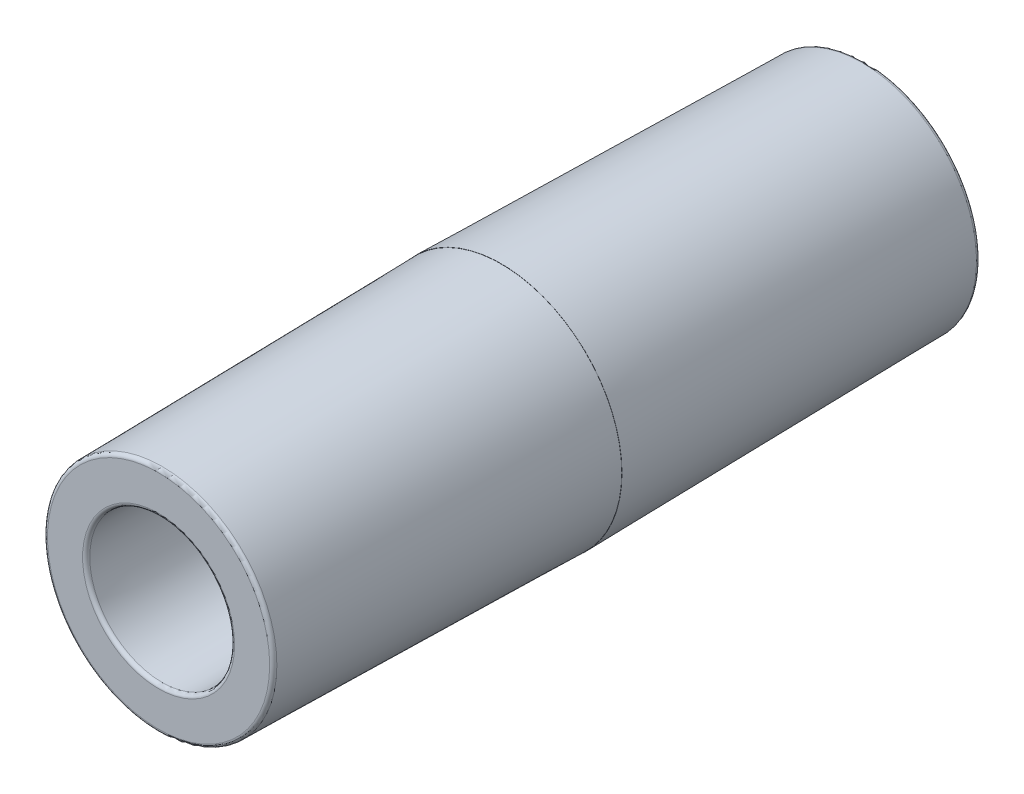
ISO-10303-21;
HEADER;
FILE_DESCRIPTION(('STEP AP214'),'2;1');
FILE_NAME('part.step','',(''),(''),'','','');
FILE_SCHEMA(('AUTOMOTIVE_DESIGN { 1 0 10303 214 1 1 1 1 }'));
ENDSEC;
DATA;
#1=APPLICATION_CONTEXT('core data for automotive mechanical design processes');
#2=APPLICATION_PROTOCOL_DEFINITION('international standard','automotive_design',2000,#1);
#3=PRODUCT_CONTEXT('',#1,'mechanical');
#4=PRODUCT('Part','Part','',(#3));
#5=PRODUCT_RELATED_PRODUCT_CATEGORY('part','',(#4));
#6=PRODUCT_DEFINITION_FORMATION('','',#4);
#7=PRODUCT_DEFINITION_CONTEXT('part definition',#1,'design');
#8=PRODUCT_DEFINITION('design','',#6,#7);
#9=PRODUCT_DEFINITION_SHAPE('','',#8);
#10=(LENGTH_UNIT() NAMED_UNIT(*) SI_UNIT(.MILLI.,.METRE.));
#11=(NAMED_UNIT(*) PLANE_ANGLE_UNIT() SI_UNIT($,.RADIAN.));
#12=(NAMED_UNIT(*) SI_UNIT($,.STERADIAN.) SOLID_ANGLE_UNIT());
#13=UNCERTAINTY_MEASURE_WITH_UNIT(LENGTH_MEASURE(1.E-05),#10,'distance_accuracy_value','');
#14=(GEOMETRIC_REPRESENTATION_CONTEXT(3) GLOBAL_UNCERTAINTY_ASSIGNED_CONTEXT((#13)) GLOBAL_UNIT_ASSIGNED_CONTEXT((#10,
#11,#12)) REPRESENTATION_CONTEXT('',''));
#15=CARTESIAN_POINT('',(0.,0.,0.));
#16=DIRECTION('',(0.,0.,1.));
#17=DIRECTION('',(1.,0.,0.));
#18=AXIS2_PLACEMENT_3D('',#15,#16,#17);
#19=CARTESIAN_POINT('',(7.99064286977399,0.,23.876));
#20=DIRECTION('',(0.,0.,1.));
#21=DIRECTION('',(1.,0.,0.));
#22=AXIS2_PLACEMENT_3D('',#19,#20,#21);
#23=PLANE('',#22);
#24=CARTESIAN_POINT('',(0.,0.,23.876));
#25=DIRECTION('',(0.,0.,1.));
#26=DIRECTION('',(1.,0.,0.));
#27=AXIS2_PLACEMENT_3D('',#24,#25,#26);
#28=CIRCLE('',#27,7.74103776494259);
#29=CARTESIAN_POINT('',(7.7410377649426,0.,23.876));
#30=VERTEX_POINT('',#29);
#31=EDGE_CURVE('E53',#30,#30,#28,.T.);
#32=ORIENTED_EDGE('',*,*,#31,.T.);
#33=EDGE_LOOP('',(#32));
#34=FACE_BOUND('',#33,.T.);
#35=CARTESIAN_POINT('',(0.,0.,23.876));
#36=DIRECTION('',(0.,0.,1.));
#37=DIRECTION('',(1.,0.,0.));
#38=AXIS2_PLACEMENT_3D('',#35,#36,#37);
#39=CIRCLE('',#38,5.29885574286328);
#40=CARTESIAN_POINT('',(5.29885574286328,0.,23.876));
#41=VERTEX_POINT('',#40);
#42=EDGE_CURVE('E56',#41,#41,#39,.F.);
#43=ORIENTED_EDGE('',*,*,#42,.T.);
#44=EDGE_LOOP('',(#43));
#45=FACE_BOUND('',#44,.T.);
#46=ADVANCED_FACE('F30',(#34,#45),#23,.T.);
#47=CARTESIAN_POINT('',(0.,0.,23.876));
#48=DIRECTION('',(0.,0.,1.));
#49=DIRECTION('',(1.,0.,0.));
#50=AXIS2_PLACEMENT_3D('',#47,#48,#49);
#51=CONICAL_SURFACE('',#50,5.04706269537215,0.00872664625996588);
#52=CARTESIAN_POINT('',(0.,0.,23.6242165400165));
#53=DIRECTION('',(0.,0.,-1.));
#54=DIRECTION('',(-1.,0.,0.));
#55=AXIS2_PLACEMENT_3D('',#52,#53,#54);
#56=CIRCLE('',#55,5.04486541440497);
#57=CARTESIAN_POINT('',(-5.04486541440497,0.,23.6242165400165));
#58=VERTEX_POINT('',#57);
#59=EDGE_CURVE('E50',#58,#58,#56,.F.);
#60=ORIENTED_EDGE('',*,*,#59,.T.);
#61=EDGE_LOOP('',(#60));
#62=FACE_BOUND('',#61,.T.);
#63=CARTESIAN_POINT('',(0.,0.,0.));
#64=DIRECTION('',(0.,0.,-1.));
#65=DIRECTION('',(-1.,0.,0.));
#66=AXIS2_PLACEMENT_3D('',#63,#64,#65);
#67=CIRCLE('',#66,4.83870000000013);
#68=CARTESIAN_POINT('',(-4.83870000000012,0.,0.));
#69=VERTEX_POINT('',#68);
#70=EDGE_CURVE('E62',#69,#69,#67,.T.);
#71=ORIENTED_EDGE('',*,*,#70,.T.);
#72=EDGE_LOOP('',(#71));
#73=FACE_BOUND('',#72,.T.);
#74=ADVANCED_FACE('F93',(#62,#73),#51,.F.);
#75=CARTESIAN_POINT('',(4.83870000000014,0.,0.));
#76=DIRECTION('',(0.,0.,-1.));
#77=DIRECTION('',(-1.,0.,0.));
#78=AXIS2_PLACEMENT_3D('',#75,#76,#77);
#79=PLANE('',#78);
#80=CARTESIAN_POINT('',(0.,0.,0.));
#81=DIRECTION('',(0.,0.,-1.));
#82=DIRECTION('',(-1.,0.,0.));
#83=AXIS2_PLACEMENT_3D('',#80,#81,#82);
#84=CIRCLE('',#83,4.85140000000023);
#85=CARTESIAN_POINT('',(-4.85140000000023,0.,0.));
#86=VERTEX_POINT('',#85);
#87=EDGE_CURVE('E65',#86,#86,#84,.T.);
#88=ORIENTED_EDGE('',*,*,#87,.T.);
#89=EDGE_LOOP('',(#88));
#90=FACE_BOUND('',#89,.T.);
#91=ORIENTED_EDGE('',*,*,#70,.F.);
#92=EDGE_LOOP('',(#91));
#93=FACE_BOUND('',#92,.T.);
#94=ADVANCED_FACE('F99',(#90,#93),#79,.T.);
#95=CARTESIAN_POINT('',(0.,0.,0.));
#96=DIRECTION('',(0.,0.,-1.));
#97=DIRECTION('',(-1.,0.,0.));
#98=AXIS2_PLACEMENT_3D('',#95,#96,#97);
#99=CONICAL_SURFACE('',#98,4.85140000000023,0.00872664625996334);
#100=CARTESIAN_POINT('',(0.,0.,-25.1482165400165));
#101=DIRECTION('',(0.,0.,1.));
#102=DIRECTION('',(1.,0.,0.));
#103=AXIS2_PLACEMENT_3D('',#100,#101,#102);
#104=CIRCLE('',#103,5.07086516091812);
#105=CARTESIAN_POINT('',(5.07086516091813,0.,-25.1482165400165));
#106=VERTEX_POINT('',#105);
#107=EDGE_CURVE('E45',#106,#106,#104,.F.);
#108=ORIENTED_EDGE('',*,*,#107,.T.);
#109=EDGE_LOOP('',(#108));
#110=FACE_BOUND('',#109,.T.);
#111=ORIENTED_EDGE('',*,*,#87,.F.);
#112=EDGE_LOOP('',(#111));
#113=FACE_BOUND('',#112,.T.);
#114=ADVANCED_FACE('F117',(#110,#113),#99,.F.);
#115=CARTESIAN_POINT('',(5.0730624418853,0.,-25.4));
#116=DIRECTION('',(0.,0.,-1.));
#117=DIRECTION('',(-1.,0.,0.));
#118=AXIS2_PLACEMENT_3D('',#115,#116,#117);
#119=PLANE('',#118);
#120=CARTESIAN_POINT('',(0.,0.,-25.4));
#121=DIRECTION('',(0.,0.,-1.));
#122=DIRECTION('',(-1.,0.,0.));
#123=AXIS2_PLACEMENT_3D('',#120,#121,#122);
#124=CIRCLE('',#123,5.32485548937642);
#125=CARTESIAN_POINT('',(-5.32485548937642,0.,-25.4));
#126=VERTEX_POINT('',#125);
#127=EDGE_CURVE('E37',#126,#126,#124,.F.);
#128=ORIENTED_EDGE('',*,*,#127,.T.);
#129=EDGE_LOOP('',(#128));
#130=FACE_BOUND('',#129,.T.);
#131=CARTESIAN_POINT('',(0.,0.,-25.4));
#132=DIRECTION('',(0.,0.,-1.));
#133=DIRECTION('',(-1.,0.,0.));
#134=AXIS2_PLACEMENT_3D('',#131,#132,#133);
#135=CIRCLE('',#134,7.72713624599179);
#136=CARTESIAN_POINT('',(-7.72713624599178,0.,-25.4));
#137=VERTEX_POINT('',#136);
#138=EDGE_CURVE('E41',#137,#137,#135,.T.);
#139=ORIENTED_EDGE('',*,*,#138,.T.);
#140=EDGE_LOOP('',(#139));
#141=FACE_BOUND('',#140,.T.);
#142=ADVANCED_FACE('F120',(#130,#141),#119,.T.);
#143=CARTESIAN_POINT('',(0.,0.,-25.4));
#144=DIRECTION('',(0.,0.,1.));
#145=DIRECTION('',(1.,0.,0.));
#146=AXIS2_PLACEMENT_3D('',#143,#144,#145);
#147=CONICAL_SURFACE('',#146,7.97674135082317,0.0174532925199473);
#148=CARTESIAN_POINT('',(0.,0.,-25.1504329112351));
#149=DIRECTION('',(0.,0.,-1.));
#150=DIRECTION('',(-1.,0.,0.));
#151=AXIS2_PLACEMENT_3D('',#148,#149,#150);
#152=CIRCLE('',#151,7.98109756056151);
#153=CARTESIAN_POINT('',(-7.9810975605615,0.,-25.1504329112351));
#154=VERTEX_POINT('',#153);
#155=EDGE_CURVE('E10',#154,#154,#152,.F.);
#156=ORIENTED_EDGE('',*,*,#155,.T.);
#157=EDGE_LOOP('',(#156));
#158=FACE_BOUND('',#157,.T.);
#159=CARTESIAN_POINT('',(0.,0.,0.));
#160=DIRECTION('',(0.,0.,-1.));
#161=DIRECTION('',(-1.,0.,0.));
#162=AXIS2_PLACEMENT_3D('',#159,#160,#161);
#163=CIRCLE('',#162,8.4201);
#164=CARTESIAN_POINT('',(-8.42009999999999,0.,0.));
#165=VERTEX_POINT('',#164);
#166=EDGE_CURVE('E68',#165,#165,#163,.T.);
#167=ORIENTED_EDGE('',*,*,#166,.T.);
#168=EDGE_LOOP('',(#167));
#169=FACE_BOUND('',#168,.T.);
#170=ADVANCED_FACE('F90',(#158,#169),#147,.T.);
#171=CARTESIAN_POINT('',(8.42010000000001,0.,0.));
#172=DIRECTION('',(0.,0.,1.));
#173=DIRECTION('',(1.,0.,0.));
#174=AXIS2_PLACEMENT_3D('',#171,#172,#173);
#175=PLANE('',#174);
#176=CARTESIAN_POINT('',(0.,0.,0.));
#177=DIRECTION('',(0.,0.,-1.));
#178=DIRECTION('',(-1.,0.,0.));
#179=AXIS2_PLACEMENT_3D('',#176,#177,#178);
#180=CIRCLE('',#179,8.4074);
#181=CARTESIAN_POINT('',(-8.40739999999999,0.,0.));
#182=VERTEX_POINT('',#181);
#183=EDGE_CURVE('E71',#182,#182,#180,.T.);
#184=ORIENTED_EDGE('',*,*,#183,.T.);
#185=EDGE_LOOP('',(#184));
#186=FACE_BOUND('',#185,.T.);
#187=ORIENTED_EDGE('',*,*,#166,.F.);
#188=EDGE_LOOP('',(#187));
#189=FACE_BOUND('',#188,.T.);
#190=ADVANCED_FACE('F75',(#186,#189),#175,.T.);
#191=CARTESIAN_POINT('',(0.,0.,0.));
#192=DIRECTION('',(0.,0.,-1.));
#193=DIRECTION('',(-1.,0.,0.));
#194=AXIS2_PLACEMENT_3D('',#191,#192,#193);
#195=CONICAL_SURFACE('',#194,8.4074,0.0174532925199389);
#196=CARTESIAN_POINT('',(0.,0.,23.626432911235));
#197=DIRECTION('',(0.,0.,1.));
#198=DIRECTION('',(1.,0.,0.));
#199=AXIS2_PLACEMENT_3D('',#196,#197,#198);
#200=CIRCLE('',#199,7.99499907951232);
#201=CARTESIAN_POINT('',(7.99499907951232,0.,23.626432911235));
#202=VERTEX_POINT('',#201);
#203=EDGE_CURVE('E59',#202,#202,#200,.F.);
#204=ORIENTED_EDGE('',*,*,#203,.T.);
#205=EDGE_LOOP('',(#204));
#206=FACE_BOUND('',#205,.T.);
#207=ORIENTED_EDGE('',*,*,#183,.F.);
#208=EDGE_LOOP('',(#207));
#209=FACE_BOUND('',#208,.T.);
#210=ADVANCED_FACE('F78',(#206,#209),#195,.T.);
#211=CARTESIAN_POINT('',(0.,0.,23.622));
#212=DIRECTION('',(0.,0.,1.));
#213=DIRECTION('',(1.,0.,0.));
#214=AXIS2_PLACEMENT_3D('',#211,#212,#213);
#215=TOROIDAL_SURFACE('',#214,7.74103776494259,0.254);
#216=ORIENTED_EDGE('',*,*,#31,.F.);
#217=EDGE_LOOP('',(#216));
#218=FACE_BOUND('',#217,.T.);
#219=ORIENTED_EDGE('',*,*,#203,.F.);
#220=EDGE_LOOP('',(#219));
#221=FACE_BOUND('',#220,.T.);
#222=ADVANCED_FACE('F80',(#218,#221),#215,.T.);
#223=CARTESIAN_POINT('',(0.,0.,23.622));
#224=DIRECTION('',(0.,0.,1.));
#225=DIRECTION('',(1.,0.,0.));
#226=AXIS2_PLACEMENT_3D('',#223,#224,#225);
#227=TOROIDAL_SURFACE('',#226,5.29885574286328,0.254);
#228=ORIENTED_EDGE('',*,*,#59,.F.);
#229=EDGE_LOOP('',(#228));
#230=FACE_BOUND('',#229,.T.);
#231=ORIENTED_EDGE('',*,*,#42,.F.);
#232=EDGE_LOOP('',(#231));
#233=FACE_BOUND('',#232,.T.);
#234=ADVANCED_FACE('F87',(#230,#233),#227,.T.);
#235=CARTESIAN_POINT('',(0.,0.,-25.146));
#236=DIRECTION('',(0.,0.,-1.));
#237=DIRECTION('',(-1.,0.,0.));
#238=AXIS2_PLACEMENT_3D('',#235,#236,#237);
#239=TOROIDAL_SURFACE('',#238,5.32485548937642,0.254);
#240=ORIENTED_EDGE('',*,*,#127,.F.);
#241=EDGE_LOOP('',(#240));
#242=FACE_BOUND('',#241,.T.);
#243=ORIENTED_EDGE('',*,*,#107,.F.);
#244=EDGE_LOOP('',(#243));
#245=FACE_BOUND('',#244,.T.);
#246=ADVANCED_FACE('F106',(#242,#245),#239,.T.);
#247=CARTESIAN_POINT('',(0.,0.,-25.146));
#248=DIRECTION('',(0.,0.,-1.));
#249=DIRECTION('',(-1.,0.,0.));
#250=AXIS2_PLACEMENT_3D('',#247,#248,#249);
#251=TOROIDAL_SURFACE('',#250,7.72713624599179,0.254);
#252=ORIENTED_EDGE('',*,*,#155,.F.);
#253=EDGE_LOOP('',(#252));
#254=FACE_BOUND('',#253,.T.);
#255=ORIENTED_EDGE('',*,*,#138,.F.);
#256=EDGE_LOOP('',(#255));
#257=FACE_BOUND('',#256,.T.);
#258=ADVANCED_FACE('F32',(#254,#257),#251,.T.);
#259=CLOSED_SHELL('',(#46,#74,#94,#114,#142,#170,#190,#210,#222,#234,#246,#258));
#260=MANIFOLD_SOLID_BREP('B2',#259);
#261=ADVANCED_BREP_SHAPE_REPRESENTATION('',(#18,#260),#14);
#262=SHAPE_DEFINITION_REPRESENTATION(#9,#261);
ENDSEC;
END-ISO-10303-21;
